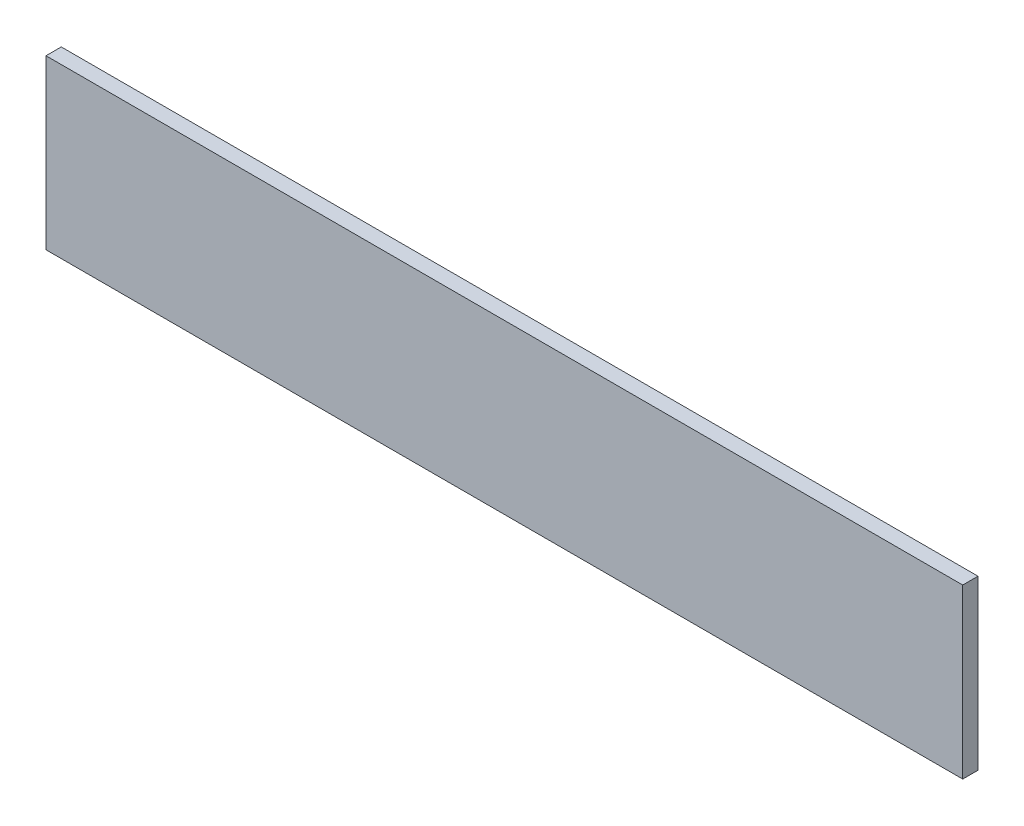
ISO-10303-21;
HEADER;
FILE_DESCRIPTION(('STEP AP214'),'2;1');
FILE_NAME('part.step','',(''),(''),'','','');
FILE_SCHEMA(('AUTOMOTIVE_DESIGN { 1 0 10303 214 1 1 1 1 }'));
ENDSEC;
DATA;
#1=APPLICATION_CONTEXT('core data for automotive mechanical design processes');
#2=APPLICATION_PROTOCOL_DEFINITION('international standard','automotive_design',2000,#1);
#3=PRODUCT_CONTEXT('',#1,'mechanical');
#4=PRODUCT('Part','Part','',(#3));
#5=PRODUCT_RELATED_PRODUCT_CATEGORY('part','',(#4));
#6=PRODUCT_DEFINITION_FORMATION('','',#4);
#7=PRODUCT_DEFINITION_CONTEXT('part definition',#1,'design');
#8=PRODUCT_DEFINITION('design','',#6,#7);
#9=PRODUCT_DEFINITION_SHAPE('','',#8);
#10=(LENGTH_UNIT() NAMED_UNIT(*) SI_UNIT(.MILLI.,.METRE.));
#11=(NAMED_UNIT(*) PLANE_ANGLE_UNIT() SI_UNIT($,.RADIAN.));
#12=(NAMED_UNIT(*) SI_UNIT($,.STERADIAN.) SOLID_ANGLE_UNIT());
#13=UNCERTAINTY_MEASURE_WITH_UNIT(LENGTH_MEASURE(1.E-05),#10,'distance_accuracy_value','');
#14=(GEOMETRIC_REPRESENTATION_CONTEXT(3) GLOBAL_UNCERTAINTY_ASSIGNED_CONTEXT((#13)) GLOBAL_UNIT_ASSIGNED_CONTEXT((#10,
#11,#12)) REPRESENTATION_CONTEXT('',''));
#15=CARTESIAN_POINT('',(0.,0.,0.));
#16=DIRECTION('',(0.,0.,1.));
#17=DIRECTION('',(1.,0.,0.));
#18=AXIS2_PLACEMENT_3D('',#15,#16,#17);
#19=CARTESIAN_POINT('',(-600.,0.,10.));
#20=DIRECTION('',(1.,0.,0.));
#21=DIRECTION('',(0.,0.,-1.));
#22=AXIS2_PLACEMENT_3D('',#19,#20,#21);
#23=PLANE('',#22);
#24=DIRECTION('',(0.,-1.,0.));
#25=VECTOR('',#24,1.);
#26=CARTESIAN_POINT('',(-600.,0.,0.));
#27=LINE('',#26,#25);
#28=CARTESIAN_POINT('',(-600.,0.,0.));
#29=VERTEX_POINT('',#28);
#30=CARTESIAN_POINT('',(-600.,-110.,0.));
#31=VERTEX_POINT('',#30);
#32=EDGE_CURVE('E96',#29,#31,#27,.T.);
#33=ORIENTED_EDGE('',*,*,#32,.T.);
#34=DIRECTION('',(0.,0.,-1.));
#35=VECTOR('',#34,1.);
#36=CARTESIAN_POINT('',(-600.,-110.,10.));
#37=LINE('',#36,#35);
#38=CARTESIAN_POINT('',(-600.,-110.,10.));
#39=VERTEX_POINT('',#38);
#40=EDGE_CURVE('E11',#39,#31,#37,.T.);
#41=ORIENTED_EDGE('',*,*,#40,.F.);
#42=DIRECTION('',(0.,-1.,0.));
#43=VECTOR('',#42,1.);
#44=CARTESIAN_POINT('',(-600.,0.,10.));
#45=LINE('',#44,#43);
#46=CARTESIAN_POINT('',(-600.,0.,10.));
#47=VERTEX_POINT('',#46);
#48=EDGE_CURVE('E84',#47,#39,#45,.T.);
#49=ORIENTED_EDGE('',*,*,#48,.F.);
#50=DIRECTION('',(0.,0.,-1.));
#51=VECTOR('',#50,1.);
#52=CARTESIAN_POINT('',(-600.,0.,10.));
#53=LINE('',#52,#51);
#54=EDGE_CURVE('E92',#47,#29,#53,.T.);
#55=ORIENTED_EDGE('',*,*,#54,.T.);
#56=EDGE_LOOP('',(#33,#41,#49,#55));
#57=FACE_BOUND('',#56,.T.);
#58=ADVANCED_FACE('F33',(#57),#23,.F.);
#59=CARTESIAN_POINT('',(-600.,-110.,10.));
#60=DIRECTION('',(0.,1.,0.));
#61=DIRECTION('',(-1.,0.,0.));
#62=AXIS2_PLACEMENT_3D('',#59,#60,#61);
#63=PLANE('',#62);
#64=DIRECTION('',(1.,0.,0.));
#65=VECTOR('',#64,1.);
#66=CARTESIAN_POINT('',(-600.,-110.,0.));
#67=LINE('',#66,#65);
#68=CARTESIAN_POINT('',(-4.44089209850063E-13,-110.,0.));
#69=VERTEX_POINT('',#68);
#70=EDGE_CURVE('E88',#31,#69,#67,.T.);
#71=ORIENTED_EDGE('',*,*,#70,.T.);
#72=DIRECTION('',(0.,0.,-1.));
#73=VECTOR('',#72,1.);
#74=CARTESIAN_POINT('',(-4.44089209850063E-13,-110.,10.));
#75=LINE('',#74,#73);
#76=CARTESIAN_POINT('',(-4.44089209850063E-13,-110.,10.));
#77=VERTEX_POINT('',#76);
#78=EDGE_CURVE('E41',#77,#69,#75,.T.);
#79=ORIENTED_EDGE('',*,*,#78,.F.);
#80=DIRECTION('',(1.,0.,0.));
#81=VECTOR('',#80,1.);
#82=CARTESIAN_POINT('',(-600.,-110.,10.));
#83=LINE('',#82,#81);
#84=EDGE_CURVE('E79',#39,#77,#83,.T.);
#85=ORIENTED_EDGE('',*,*,#84,.F.);
#86=ORIENTED_EDGE('',*,*,#40,.T.);
#87=EDGE_LOOP('',(#71,#79,#85,#86));
#88=FACE_BOUND('',#87,.T.);
#89=ADVANCED_FACE('F87',(#88),#63,.F.);
#90=CARTESIAN_POINT('',(0.,0.,10.));
#91=DIRECTION('',(-1.,0.,0.));
#92=DIRECTION('',(0.,-1.,0.));
#93=AXIS2_PLACEMENT_3D('',#90,#91,#92);
#94=PLANE('',#93);
#95=DIRECTION('',(0.,1.,0.));
#96=VECTOR('',#95,1.);
#97=CARTESIAN_POINT('',(0.,0.,0.));
#98=LINE('',#97,#96);
#99=CARTESIAN_POINT('',(0.,0.,0.));
#100=VERTEX_POINT('',#99);
#101=EDGE_CURVE('E66',#69,#100,#98,.T.);
#102=ORIENTED_EDGE('',*,*,#101,.T.);
#103=DIRECTION('',(0.,0.,-1.));
#104=VECTOR('',#103,1.);
#105=CARTESIAN_POINT('',(0.,0.,10.));
#106=LINE('',#105,#104);
#107=CARTESIAN_POINT('',(0.,0.,10.));
#108=VERTEX_POINT('',#107);
#109=EDGE_CURVE('E89',#108,#100,#106,.T.);
#110=ORIENTED_EDGE('',*,*,#109,.F.);
#111=DIRECTION('',(0.,1.,0.));
#112=VECTOR('',#111,1.);
#113=CARTESIAN_POINT('',(0.,0.,10.));
#114=LINE('',#113,#112);
#115=EDGE_CURVE('E82',#77,#108,#114,.T.);
#116=ORIENTED_EDGE('',*,*,#115,.F.);
#117=ORIENTED_EDGE('',*,*,#78,.T.);
#118=EDGE_LOOP('',(#102,#110,#116,#117));
#119=FACE_BOUND('',#118,.T.);
#120=ADVANCED_FACE('F90',(#119),#94,.F.);
#121=CARTESIAN_POINT('',(-600.,0.,10.));
#122=DIRECTION('',(0.,-1.,0.));
#123=DIRECTION('',(1.,0.,0.));
#124=AXIS2_PLACEMENT_3D('',#121,#122,#123);
#125=PLANE('',#124);
#126=DIRECTION('',(-1.,0.,0.));
#127=VECTOR('',#126,1.);
#128=CARTESIAN_POINT('',(-600.,0.,0.));
#129=LINE('',#128,#127);
#130=EDGE_CURVE('E72',#100,#29,#129,.T.);
#131=ORIENTED_EDGE('',*,*,#130,.T.);
#132=ORIENTED_EDGE('',*,*,#54,.F.);
#133=DIRECTION('',(-1.,0.,0.));
#134=VECTOR('',#133,1.);
#135=CARTESIAN_POINT('',(-600.,0.,10.));
#136=LINE('',#135,#134);
#137=EDGE_CURVE('E49',#108,#47,#136,.T.);
#138=ORIENTED_EDGE('',*,*,#137,.F.);
#139=ORIENTED_EDGE('',*,*,#109,.T.);
#140=EDGE_LOOP('',(#131,#132,#138,#139));
#141=FACE_BOUND('',#140,.T.);
#142=ADVANCED_FACE('F103',(#141),#125,.F.);
#143=CARTESIAN_POINT('',(0.,0.,10.));
#144=DIRECTION('',(0.,0.,1.));
#145=DIRECTION('',(1.,0.,0.));
#146=AXIS2_PLACEMENT_3D('',#143,#144,#145);
#147=PLANE('',#146);
#148=ORIENTED_EDGE('',*,*,#48,.T.);
#149=ORIENTED_EDGE('',*,*,#84,.T.);
#150=ORIENTED_EDGE('',*,*,#115,.T.);
#151=ORIENTED_EDGE('',*,*,#137,.T.);
#152=EDGE_LOOP('',(#148,#149,#150,#151));
#153=FACE_BOUND('',#152,.T.);
#154=ADVANCED_FACE('F80',(#153),#147,.T.);
#155=CARTESIAN_POINT('',(0.,0.,0.));
#156=DIRECTION('',(0.,0.,1.));
#157=DIRECTION('',(1.,0.,0.));
#158=AXIS2_PLACEMENT_3D('',#155,#156,#157);
#159=PLANE('',#158);
#160=ORIENTED_EDGE('',*,*,#32,.F.);
#161=ORIENTED_EDGE('',*,*,#130,.F.);
#162=ORIENTED_EDGE('',*,*,#101,.F.);
#163=ORIENTED_EDGE('',*,*,#70,.F.);
#164=EDGE_LOOP('',(#160,#161,#162,#163));
#165=FACE_BOUND('',#164,.T.);
#166=ADVANCED_FACE('F106',(#165),#159,.F.);
#167=CLOSED_SHELL('',(#58,#89,#120,#142,#154,#166));
#168=MANIFOLD_SOLID_BREP('B2',#167);
#169=ADVANCED_BREP_SHAPE_REPRESENTATION('',(#18,#168),#14);
#170=SHAPE_DEFINITION_REPRESENTATION(#9,#169);
ENDSEC;
END-ISO-10303-21;
